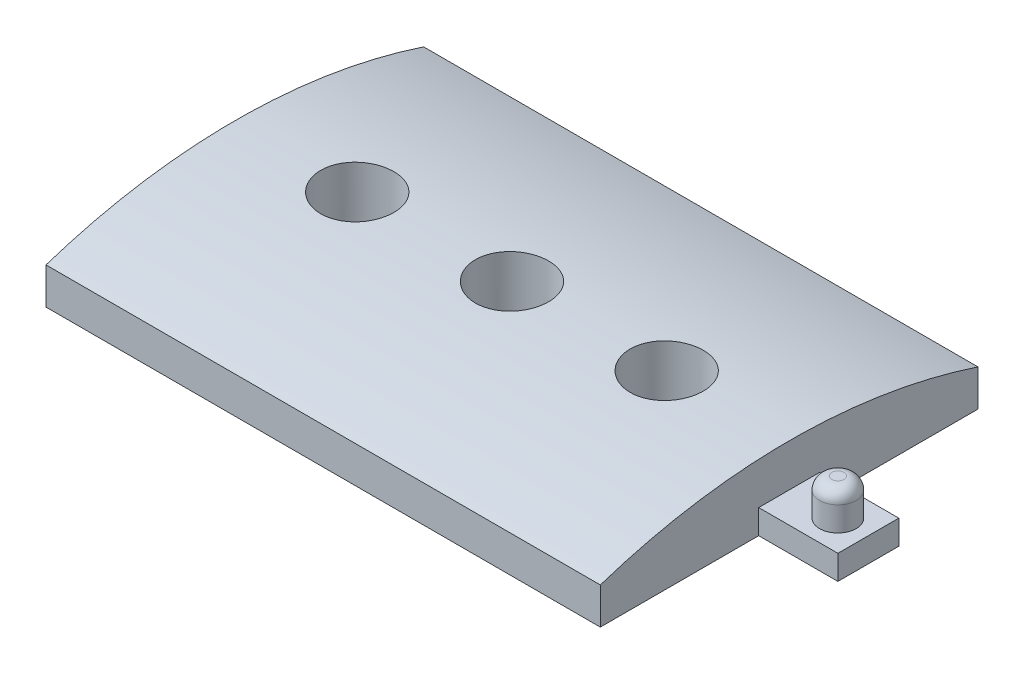
ISO-10303-21;
HEADER;
FILE_DESCRIPTION(('STEP AP214'),'2;1');
FILE_NAME('part.step','',(''),(''),'','','');
FILE_SCHEMA(('AUTOMOTIVE_DESIGN { 1 0 10303 214 1 1 1 1 }'));
ENDSEC;
DATA;
#1=APPLICATION_CONTEXT('core data for automotive mechanical design processes');
#2=APPLICATION_PROTOCOL_DEFINITION('international standard','automotive_design',2000,#1);
#3=PRODUCT_CONTEXT('',#1,'mechanical');
#4=PRODUCT('Part','Part','',(#3));
#5=PRODUCT_RELATED_PRODUCT_CATEGORY('part','',(#4));
#6=PRODUCT_DEFINITION_FORMATION('','',#4);
#7=PRODUCT_DEFINITION_CONTEXT('part definition',#1,'design');
#8=PRODUCT_DEFINITION('design','',#6,#7);
#9=PRODUCT_DEFINITION_SHAPE('','',#8);
#10=(LENGTH_UNIT() NAMED_UNIT(*) SI_UNIT(.MILLI.,.METRE.));
#11=(NAMED_UNIT(*) PLANE_ANGLE_UNIT() SI_UNIT($,.RADIAN.));
#12=(NAMED_UNIT(*) SI_UNIT($,.STERADIAN.) SOLID_ANGLE_UNIT());
#13=UNCERTAINTY_MEASURE_WITH_UNIT(LENGTH_MEASURE(1.E-05),#10,'distance_accuracy_value','');
#14=(GEOMETRIC_REPRESENTATION_CONTEXT(3) GLOBAL_UNCERTAINTY_ASSIGNED_CONTEXT((#13)) GLOBAL_UNIT_ASSIGNED_CONTEXT((#10,
#11,#12)) REPRESENTATION_CONTEXT('',''));
#15=CARTESIAN_POINT('',(0.,0.,0.));
#16=DIRECTION('',(0.,0.,1.));
#17=DIRECTION('',(1.,0.,0.));
#18=AXIS2_PLACEMENT_3D('',#15,#16,#17);
#19=CARTESIAN_POINT('',(107.701286160336,-87.6000000000001,0.));
#20=DIRECTION('',(-1.,0.,0.));
#21=DIRECTION('',(0.,0.,1.));
#22=AXIS2_PLACEMENT_3D('',#19,#20,#21);
#23=CYLINDRICAL_SURFACE('',#22,98.6000000000001);
#24=CARTESIAN_POINT('',(45.5,-87.6000000000001,0.));
#25=DIRECTION('',(-1.,0.,0.));
#26=DIRECTION('',(0.,0.,1.));
#27=AXIS2_PLACEMENT_3D('',#24,#25,#26);
#28=CIRCLE('',#27,98.6000000000001);
#29=CARTESIAN_POINT('',(45.5,6.,-31.));
#30=VERTEX_POINT('',#29);
#31=CARTESIAN_POINT('',(45.5,6.,31.));
#32=VERTEX_POINT('',#31);
#33=EDGE_CURVE('E135',#30,#32,#28,.F.);
#34=ORIENTED_EDGE('',*,*,#33,.F.);
#35=DIRECTION('',(-1.,0.,0.));
#36=VECTOR('',#35,1.);
#37=CARTESIAN_POINT('',(-45.5,6.,-31.));
#38=LINE('',#37,#36);
#39=CARTESIAN_POINT('',(-45.5,6.,-31.));
#40=VERTEX_POINT('',#39);
#41=EDGE_CURVE('E99',#30,#40,#38,.T.);
#42=ORIENTED_EDGE('',*,*,#41,.T.);
#43=CARTESIAN_POINT('',(-45.5,-87.6000000000001,0.));
#44=DIRECTION('',(-1.,0.,0.));
#45=DIRECTION('',(0.,0.,-1.));
#46=AXIS2_PLACEMENT_3D('',#43,#44,#45);
#47=CIRCLE('',#46,98.6000000000001);
#48=CARTESIAN_POINT('',(-45.5,6.,31.));
#49=VERTEX_POINT('',#48);
#50=EDGE_CURVE('E142',#49,#40,#47,.T.);
#51=ORIENTED_EDGE('',*,*,#50,.F.);
#52=DIRECTION('',(1.,0.,0.));
#53=VECTOR('',#52,1.);
#54=CARTESIAN_POINT('',(-45.5,6.,31.));
#55=LINE('',#54,#53);
#56=EDGE_CURVE('E127',#49,#32,#55,.T.);
#57=ORIENTED_EDGE('',*,*,#56,.T.);
#58=EDGE_LOOP('',(#34,#42,#51,#57));
#59=FACE_BOUND('',#58,.T.);
#60=CARTESIAN_POINT('',(19.4,11.,0.));
#61=CARTESIAN_POINT('',(19.3999986321025,11.000000229658,-0.168404413600146));
#62=CARTESIAN_POINT('',(19.4070928390863,10.999567663761,-0.336786986551726));
#63=CARTESIAN_POINT('',(19.4354190000614,10.9978499742835,-0.672409169286409));
#64=CARTESIAN_POINT('',(19.4566545520299,10.9965646337322,-0.839648477246152));
#65=CARTESIAN_POINT('',(19.5131402179147,10.9931758595845,-1.17187936018386));
#66=CARTESIAN_POINT('',(19.5484023298773,10.9910717256417,-1.33686888545236));
#67=CARTESIAN_POINT('',(19.6327025236125,10.986104246697,-1.66334370325823));
#68=CARTESIAN_POINT('',(19.6817456420605,10.9832406241391,-1.82482769130483));
#69=CARTESIAN_POINT('',(19.793200799089,10.9768385960297,-2.14293766353576));
#70=CARTESIAN_POINT('',(19.8556008462217,10.9733007960451,-2.29956786185985));
#71=CARTESIAN_POINT('',(19.9933755810975,10.9656474543999,-2.60706873711054));
#72=CARTESIAN_POINT('',(20.0687550447709,10.9615317001773,-2.75793726890809));
#73=CARTESIAN_POINT('',(20.2318865655336,10.9528425260403,-3.05269724160954));
#74=CARTESIAN_POINT('',(20.3196311631378,10.9482693825333,-3.19659281924973));
#75=CARTESIAN_POINT('',(20.5069391147091,10.9387908229136,-3.47653984698354));
#76=CARTESIAN_POINT('',(20.6065068248148,10.9338852846202,-3.61258837829007));
#77=CARTESIAN_POINT('',(20.8168233714441,10.9238776596673,-3.87594041006536));
#78=CARTESIAN_POINT('',(20.9275820694516,10.9187754021507,-4.00323602855471));
#79=CARTESIAN_POINT('',(21.1594652748157,10.9085210417277,-4.24809453220113));
#80=CARTESIAN_POINT('',(21.2805935961729,10.9033689211048,-4.36565380473109));
#81=CARTESIAN_POINT('',(21.5322822594511,10.8931644296815,-4.59011796019534));
#82=CARTESIAN_POINT('',(21.6628395035259,10.8881120268077,-4.69702631523764));
#83=CARTESIAN_POINT('',(21.9325473852962,10.8782466491957,-4.89951211913757));
#84=CARTESIAN_POINT('',(22.0717011772949,10.8734337635265,-4.99508537083317));
#85=CARTESIAN_POINT('',(22.3576314062376,10.8641842867918,-5.17421139305048));
#86=CARTESIAN_POINT('',(22.5044108403343,10.8597478455144,-5.25775938781928));
#87=CARTESIAN_POINT('',(22.8045520854735,10.8513780162472,-5.4122224236668));
#88=CARTESIAN_POINT('',(22.9579163095742,10.8474448148126,-5.48313278367825));
#89=CARTESIAN_POINT('',(23.27004349295,10.8401971327605,-5.61175110253336));
#90=CARTESIAN_POINT('',(23.4288043914026,10.8368824190311,-5.66946403743035));
#91=CARTESIAN_POINT('',(23.7506499575588,10.8309624687199,-5.77132480013478));
#92=CARTESIAN_POINT('',(23.9137361975389,10.8283574941197,-5.81546761966182));
#93=CARTESIAN_POINT('',(24.4072211348461,10.8217360556224,-5.9268649321302));
#94=CARTESIAN_POINT('',(24.7425812887715,10.8188954689223,-5.97339041077554));
#95=CARTESIAN_POINT('',(25.4161803609237,10.8166988396797,-6.00946456516706));
#96=CARTESIAN_POINT('',(25.7544192479374,10.8173427594038,-5.99901385790196));
#97=CARTESIAN_POINT('',(26.4239227236938,10.8220329413092,-5.92156388811038));
#98=CARTESIAN_POINT('',(26.7551959977812,10.8260746728429,-5.85463992666142));
#99=CARTESIAN_POINT('',(27.401784901934,10.8370994378133,-5.66624021503213));
#100=CARTESIAN_POINT('',(27.7171004404362,10.8440824881246,-5.54476415187887));
#101=CARTESIAN_POINT('',(28.3230812375132,10.8602077237547,-5.25062819961125));
#102=CARTESIAN_POINT('',(28.6137298616548,10.8693513506043,-5.07793411825943));
#103=CARTESIAN_POINT('',(29.1619402151687,10.8887659564162,-4.68628766227296));
#104=CARTESIAN_POINT('',(29.4195015925214,10.8990369473706,-4.46733479555052));
#105=CARTESIAN_POINT('',(29.8946656354831,10.9195688821282,-3.98896207160927));
#106=CARTESIAN_POINT('',(30.1122026761889,10.9298297824703,-3.72947702213265));
#107=CARTESIAN_POINT('',(30.5006365342967,10.9491691327505,-3.17763428645061));
#108=CARTESIAN_POINT('',(30.6715333361811,10.9582475822952,-2.88527658930834));
#109=CARTESIAN_POINT('',(30.9618300028031,10.9741996739195,-2.2759479519847));
#110=CARTESIAN_POINT('',(31.0812274102538,10.981073210788,-1.95897583818103));
#111=CARTESIAN_POINT('',(31.2650923079146,10.9918394802028,-1.30943370866304));
#112=CARTESIAN_POINT('',(31.3295604063244,10.9957322457533,-0.976863865696146));
#113=CARTESIAN_POINT('',(31.4016554260109,11.0000940572429,-0.306136154127039));
#114=CARTESIAN_POINT('',(31.40937308585,11.000568568621,0.0320119272216248));
#115=CARTESIAN_POINT('',(31.3679851885813,10.998054933762,0.704797930150374));
#116=CARTESIAN_POINT('',(31.3188799115715,10.9950668045932,1.03943586902483));
#117=CARTESIAN_POINT('',(31.165315210082,10.9859678197957,1.69544702060426));
#118=CARTESIAN_POINT('',(31.060897387574,10.9798593112066,2.01683000714486));
#119=CARTESIAN_POINT('',(30.7997137904376,10.9652068701669,2.63750994271739));
#120=CARTESIAN_POINT('',(30.6429475693133,10.9566629169437,2.93680670334238));
#121=CARTESIAN_POINT('',(30.2812863369532,10.9380861568064,3.50523396672023));
#122=CARTESIAN_POINT('',(30.0763306917541,10.9280514801061,3.77432582898067));
#123=CARTESIAN_POINT('',(29.6241956544052,10.9076289671518,4.27431571859182));
#124=CARTESIAN_POINT('',(29.3770158675548,10.8972411275972,4.5052133888733));
#125=CARTESIAN_POINT('',(28.847062244764,10.8772672130113,4.9225681315088));
#126=CARTESIAN_POINT('',(28.5642420261357,10.8676822103569,5.10896636011965));
#127=CARTESIAN_POINT('',(27.9712523328972,10.8504121732547,5.43162681378833));
#128=CARTESIAN_POINT('',(27.661083019828,10.8427271275854,5.56788933495463));
#129=CARTESIAN_POINT('',(27.0224776451457,10.8301304313161,5.7863150192272));
#130=CARTESIAN_POINT('',(26.6940542791259,10.8252168790286,5.86851528412744));
#131=CARTESIAN_POINT('',(26.0278532018344,10.8187155358368,5.97657955035302));
#132=CARTESIAN_POINT('',(25.6900755776727,10.8171277139728,6.00244407611755));
#133=CARTESIAN_POINT('',(25.1843583395823,10.8173653869707,5.99850101348707));
#134=CARTESIAN_POINT('',(25.0159902563826,10.8178806779035,5.99007153183835));
#135=CARTESIAN_POINT('',(24.6805802222139,10.8197619533792,5.95908924741543));
#136=CARTESIAN_POINT('',(24.5135378038821,10.8211276232767,5.93654166840664));
#137=CARTESIAN_POINT('',(24.1819005727569,10.8246728901136,5.8774678283244));
#138=CARTESIAN_POINT('',(24.0173066874708,10.8268527877107,5.84093640351949));
#139=CARTESIAN_POINT('',(23.6918431263065,10.8319630038836,5.75417658143367));
#140=CARTESIAN_POINT('',(23.5309721035247,10.8348930462837,5.70395322457563));
#141=CARTESIAN_POINT('',(23.2139786040331,10.8414219963264,5.5901414819829));
#142=CARTESIAN_POINT('',(23.0578578642017,10.8450211452789,5.526548273392));
#143=CARTESIAN_POINT('',(22.751586368245,10.8527839386548,5.38648765319828));
#144=CARTESIAN_POINT('',(22.6014334395943,10.8569473751748,5.3100249806626));
#145=CARTESIAN_POINT('',(22.3080479068997,10.8657232602529,5.14472465747023));
#146=CARTESIAN_POINT('',(22.164817666888,10.8703358605976,5.05588281910301));
#147=CARTESIAN_POINT('',(21.8863942909173,10.8798764775494,4.86650902789028));
#148=CARTESIAN_POINT('',(21.7511982271495,10.8848043778787,4.76598137355279));
#149=CARTESIAN_POINT('',(21.4894932363414,10.8948472247035,4.55372111898794));
#150=CARTESIAN_POINT('',(21.363001111002,10.8999625052827,4.44196781813168));
#151=CARTESIAN_POINT('',(21.119923349289,10.9102244027455,4.20824920056375));
#152=CARTESIAN_POINT('',(21.0033340895992,10.9153710074228,4.08628765161431));
#153=CARTESIAN_POINT('',(20.7807664953992,10.925554798005,3.83290155872265));
#154=CARTESIAN_POINT('',(20.6747947211689,10.9305919147732,3.70147124942557));
#155=CARTESIAN_POINT('',(20.474332648823,10.940408850239,3.43019457863328));
#156=CARTESIAN_POINT('',(20.379838129921,10.9451887631615,3.29035133947521));
#157=CARTESIAN_POINT('',(20.2028176534637,10.9543650740029,3.0029687086061));
#158=CARTESIAN_POINT('',(20.1203106956577,10.9587608587951,2.85541759272442));
#159=CARTESIAN_POINT('',(19.9680600009059,10.9670340091936,2.55392595976248));
#160=CARTESIAN_POINT('',(19.8983116011887,10.9709115640533,2.39998780223936));
#161=CARTESIAN_POINT('',(19.7720946749389,10.9780368394766,2.08689792932769));
#162=CARTESIAN_POINT('',(19.7156147019479,10.9812851024927,1.92775084365926));
#163=CARTESIAN_POINT('',(19.6162764853103,10.9870630666256,1.60530452769256));
#164=CARTESIAN_POINT('',(19.5734147485516,10.9895929519905,1.44200637377908));
#165=CARTESIAN_POINT('',(19.4918550122965,10.9944423658382,1.06761341251458));
#166=CARTESIAN_POINT('',(19.4574400104625,10.9965186967876,0.855568627188631));
#167=CARTESIAN_POINT('',(19.41151339034,10.9992973667236,0.429004083006509));
#168=CARTESIAN_POINT('',(19.4000017421905,10.9999997075015,0.214484327377525));
#169=CARTESIAN_POINT('',(19.4,11.,0.));
#170=B_SPLINE_CURVE_WITH_KNOTS('',3,(#60,#61,#62,#63,#64,#65,#66,#67,#68,#69,#70,#71,#72,#73,
#74,#75,#76,#77,#78,#79,#80,#81,#82,#83,#84,#85,#86,#87,#88,#89,#90,#91,#92,#93,#94,#95,#96,#97,
#98,#99,#100,#101,#102,#103,#104,#105,#106,#107,#108,#109,#110,#111,#112,#113,#114,#115,#116,
#117,#118,#119,#120,#121,#122,#123,#124,#125,#126,#127,#128,#129,#130,#131,#132,#133,#134,#135,
#136,#137,#138,#139,#140,#141,#142,#143,#144,#145,#146,#147,#148,#149,#150,#151,#152,#153,#154,
#155,#156,#157,#158,#159,#160,#161,#162,#163,#164,#165,#166,#167,#168,#169),.UNSPECIFIED.,.T.,
.F.,(4,2,2,2,2,2,2,2,2,2,2,2,2,2,2,2,2,2,2,2,2,2,2,2,2,2,2,2,2,2,2,2,2,2,2,2,2,2,2,2,2,2,2,2,2,
2,2,2,2,2,2,2,2,2,4),(0.,0.50502581636515,1.01018017538683,1.51576756601272,2.02153997934308,
2.52686021573891,3.03236678961708,3.53756970292469,4.04295933546867,4.54879826642407,
5.05482405351433,5.56068433701458,6.0667313495032,6.57297878400881,7.07941334808698,
7.5856566463778,8.09208655862317,9.10259127011719,10.1130850389909,11.1222335470924,
12.1313878448921,13.1412173584121,14.1510576147517,15.1625391554189,16.174021032611,
17.1855511671895,18.197070101548,19.2069713607929,20.2168676419428,21.2260054306534,
22.2351518268365,23.2455748334825,24.2560072858206,25.2677685708438,26.2795238801681,
27.2905841164726,28.3016349406015,28.806882789571,29.3119438047334,29.8171915009615,
30.3222534504908,30.8274979026733,31.3325567084549,31.8377867857359,32.3428316038912,
32.848825469486,33.3546333944548,33.8607519427835,34.3666837976835,34.8734089833847,
35.3799486085494,35.8860496321286,36.3920207345209,37.035235846536,37.6784501199371),.UNSPECIFIED.);
#171=CARTESIAN_POINT('',(19.4,11.,0.));
#172=VERTEX_POINT('',#171);
#173=EDGE_CURVE('E182',#172,#172,#170,.T.);
#174=ORIENTED_EDGE('',*,*,#173,.T.);
#175=EDGE_LOOP('',(#174));
#176=FACE_BOUND('',#175,.T.);
#177=CARTESIAN_POINT('',(-6.00000000000003,11.,0.));
#178=CARTESIAN_POINT('',(-6.0000013678975,11.000000229658,-0.168404413600146));
#179=CARTESIAN_POINT('',(-5.99290716091364,10.999567663761,-0.336786986551725));
#180=CARTESIAN_POINT('',(-5.9645809999386,10.9978499742835,-0.672409169286408));
#181=CARTESIAN_POINT('',(-5.94334544797006,10.9965646337322,-0.83964847724615));
#182=CARTESIAN_POINT('',(-5.88685978208534,10.9931758595845,-1.17187936018385));
#183=CARTESIAN_POINT('',(-5.85159767012269,10.9910717256417,-1.33686888545236));
#184=CARTESIAN_POINT('',(-5.7672974763875,10.986104246697,-1.66334370325823));
#185=CARTESIAN_POINT('',(-5.71825435793953,10.9832406241391,-1.82482769130483));
#186=CARTESIAN_POINT('',(-5.60679920091101,10.9768385960297,-2.14293766353575));
#187=CARTESIAN_POINT('',(-5.54439915377834,10.9733007960451,-2.29956786185984));
#188=CARTESIAN_POINT('',(-5.40662441890252,10.9656474543999,-2.60706873711053));
#189=CARTESIAN_POINT('',(-5.3312449552291,10.9615317001773,-2.75793726890809));
#190=CARTESIAN_POINT('',(-5.16811343446634,10.9528425260403,-3.05269724160953));
#191=CARTESIAN_POINT('',(-5.08036883686218,10.9482693825333,-3.19659281924972));
#192=CARTESIAN_POINT('',(-4.89306088529088,10.9387908229136,-3.47653984698353));
#193=CARTESIAN_POINT('',(-4.79349317518516,10.9338852846202,-3.61258837829006));
#194=CARTESIAN_POINT('',(-4.58317662855591,10.9238776596673,-3.87594041006535));
#195=CARTESIAN_POINT('',(-4.47241793054841,10.9187754021507,-4.0032360285547));
#196=CARTESIAN_POINT('',(-4.24053472518432,10.9085210417277,-4.24809453220112));
#197=CARTESIAN_POINT('',(-4.11940640382706,10.9033689211048,-4.36565380473108));
#198=CARTESIAN_POINT('',(-3.86771774054888,10.8931644296816,-4.59011796019534));
#199=CARTESIAN_POINT('',(-3.73716049647405,10.8881120268077,-4.69702631523763));
#200=CARTESIAN_POINT('',(-3.46745261470377,10.8782466491957,-4.89951211913756));
#201=CARTESIAN_POINT('',(-3.32829882270514,10.8734337635265,-4.99508537083316));
#202=CARTESIAN_POINT('',(-3.04236859376242,10.8641842867918,-5.17421139305047));
#203=CARTESIAN_POINT('',(-2.8955891596657,10.8597478455144,-5.25775938781927));
#204=CARTESIAN_POINT('',(-2.5954479145265,10.8513780162472,-5.41222242366679));
#205=CARTESIAN_POINT('',(-2.44208369042577,10.8474448148126,-5.48313278367824));
#206=CARTESIAN_POINT('',(-2.12995650705003,10.8401971327605,-5.61175110253334));
#207=CARTESIAN_POINT('',(-1.97119560859741,10.8368824190311,-5.66946403743034));
#208=CARTESIAN_POINT('',(-1.64935004244119,10.8309624687199,-5.77132480013477));
#209=CARTESIAN_POINT('',(-1.48626380246111,10.8283574941197,-5.81546761966181));
#210=CARTESIAN_POINT('',(-0.992778865153893,10.8217360556224,-5.92686493213019));
#211=CARTESIAN_POINT('',(-0.657418711228511,10.8188954689223,-5.97339041077553));
#212=CARTESIAN_POINT('',(0.0161803609236574,10.8166988396797,-6.00946456516704));
#213=CARTESIAN_POINT('',(0.354419247937365,10.8173427594038,-5.99901385790195));
#214=CARTESIAN_POINT('',(1.02392272369378,10.8220329413092,-5.92156388811037));
#215=CARTESIAN_POINT('',(1.35519599778122,10.8260746728429,-5.85463992666141));
#216=CARTESIAN_POINT('',(2.00178490193404,10.8370994378133,-5.66624021503212));
#217=CARTESIAN_POINT('',(2.31710044043616,10.8440824881246,-5.54476415187886));
#218=CARTESIAN_POINT('',(2.92308123751322,10.8602077237547,-5.25062819961124));
#219=CARTESIAN_POINT('',(3.2137298616548,10.8693513506043,-5.07793411825943));
#220=CARTESIAN_POINT('',(3.76194021516869,10.8887659564162,-4.68628766227295));
#221=CARTESIAN_POINT('',(4.01950159252144,10.8990369473706,-4.46733479555051));
#222=CARTESIAN_POINT('',(4.49466563548311,10.9195688821282,-3.98896207160926));
#223=CARTESIAN_POINT('',(4.71220267618892,10.9298297824703,-3.72947702213264));
#224=CARTESIAN_POINT('',(5.10063653429665,10.9491691327505,-3.17763428645061));
#225=CARTESIAN_POINT('',(5.27153333618112,10.9582475822952,-2.88527658930834));
#226=CARTESIAN_POINT('',(5.56183000280306,10.9741996739195,-2.27594795198469));
#227=CARTESIAN_POINT('',(5.68122741025375,10.981073210788,-1.95897583818103));
#228=CARTESIAN_POINT('',(5.86509230791457,10.9918394802028,-1.30943370866303));
#229=CARTESIAN_POINT('',(5.92956040632443,10.9957322457533,-0.976863865696142));
#230=CARTESIAN_POINT('',(6.0016554260109,11.0000940572429,-0.306136154127036));
#231=CARTESIAN_POINT('',(6.00937308584999,11.000568568621,0.0320119272216275));
#232=CARTESIAN_POINT('',(5.96798518858133,10.998054933762,0.704797930150375));
#233=CARTESIAN_POINT('',(5.91887991157145,10.9950668045932,1.03943586902483));
#234=CARTESIAN_POINT('',(5.76531521008204,10.9859678197957,1.69544702060426));
#235=CARTESIAN_POINT('',(5.660897387574,10.9798593112066,2.01683000714486));
#236=CARTESIAN_POINT('',(5.3997137904376,10.9652068701669,2.63750994271739));
#237=CARTESIAN_POINT('',(5.24294756931333,10.9566629169437,2.93680670334238));
#238=CARTESIAN_POINT('',(4.88128633695315,10.9380861568064,3.50523396672022));
#239=CARTESIAN_POINT('',(4.67633069175414,10.9280514801061,3.77432582898067));
#240=CARTESIAN_POINT('',(4.2241956544052,10.9076289671518,4.27431571859182));
#241=CARTESIAN_POINT('',(3.97701586755482,10.8972411275972,4.50521338887329));
#242=CARTESIAN_POINT('',(3.447062244764,10.8772672130113,4.92256813150879));
#243=CARTESIAN_POINT('',(3.16424202613565,10.8676822103569,5.10896636011964));
#244=CARTESIAN_POINT('',(2.57125233289715,10.8504121732546,5.43162681378831));
#245=CARTESIAN_POINT('',(2.26108301982797,10.8427271275854,5.56788933495462));
#246=CARTESIAN_POINT('',(1.62247764514567,10.8301304313161,5.78631501922719));
#247=CARTESIAN_POINT('',(1.29405427912593,10.8252168790286,5.86851528412743));
#248=CARTESIAN_POINT('',(0.627853201834412,10.8187155358368,5.97657955035301));
#249=CARTESIAN_POINT('',(0.290075577672692,10.8171277139728,6.00244407611753));
#250=CARTESIAN_POINT('',(-0.215641660417663,10.8173653869707,5.99850101348706));
#251=CARTESIAN_POINT('',(-0.384009743617375,10.8178806779035,5.99007153183834));
#252=CARTESIAN_POINT('',(-0.719419777786138,10.8197619533792,5.95908924741542));
#253=CARTESIAN_POINT('',(-0.886462196117925,10.8211276232767,5.93654166840662));
#254=CARTESIAN_POINT('',(-1.21809942724309,10.8246728901136,5.87746782832439));
#255=CARTESIAN_POINT('',(-1.38269331252925,10.8268527877107,5.84093640351948));
#256=CARTESIAN_POINT('',(-1.70815687369353,10.8319630038836,5.75417658143366));
#257=CARTESIAN_POINT('',(-1.86902789647534,10.8348930462837,5.70395322457562));
#258=CARTESIAN_POINT('',(-2.18602139596691,10.8414219963264,5.59014148198289));
#259=CARTESIAN_POINT('',(-2.34214213579828,10.8450211452789,5.52654827339199));
#260=CARTESIAN_POINT('',(-2.64841363175498,10.8527839386548,5.38648765319827));
#261=CARTESIAN_POINT('',(-2.79856656040574,10.8569473751748,5.31002498066259));
#262=CARTESIAN_POINT('',(-3.09195209310034,10.8657232602529,5.14472465747022));
#263=CARTESIAN_POINT('',(-3.23518233311196,10.8703358605976,5.05588281910299));
#264=CARTESIAN_POINT('',(-3.51360570908265,10.8798764775494,4.86650902789027));
#265=CARTESIAN_POINT('',(-3.64880177285047,10.8848043778787,4.76598137355278));
#266=CARTESIAN_POINT('',(-3.91050676365855,10.8948472247035,4.55372111898793));
#267=CARTESIAN_POINT('',(-4.03699888899794,10.8999625052827,4.44196781813167));
#268=CARTESIAN_POINT('',(-4.28007665071103,10.9102244027455,4.20824920056374));
#269=CARTESIAN_POINT('',(-4.39666591040081,10.9153710074228,4.08628765161431));
#270=CARTESIAN_POINT('',(-4.61923350460081,10.925554798005,3.83290155872264));
#271=CARTESIAN_POINT('',(-4.72520527883114,10.9305919147732,3.70147124942556));
#272=CARTESIAN_POINT('',(-4.92566735117702,10.940408850239,3.43019457863328));
#273=CARTESIAN_POINT('',(-5.02016187007894,10.9451887631615,3.29035133947521));
#274=CARTESIAN_POINT('',(-5.19718234653632,10.9543650740029,3.00296870860609));
#275=CARTESIAN_POINT('',(-5.27968930434224,10.9587608587951,2.85541759272441));
#276=CARTESIAN_POINT('',(-5.43193999909409,10.9670340091936,2.55392595976248));
#277=CARTESIAN_POINT('',(-5.5016883988113,10.9709115640533,2.39998780223935));
#278=CARTESIAN_POINT('',(-5.62790532506112,10.9780368394766,2.08689792932769));
#279=CARTESIAN_POINT('',(-5.68438529805204,10.9812851024927,1.92775084365926));
#280=CARTESIAN_POINT('',(-5.7837235146897,10.9870630666256,1.60530452769256));
#281=CARTESIAN_POINT('',(-5.82658525144837,10.9895929519905,1.44200637377908));
#282=CARTESIAN_POINT('',(-5.90814498770351,10.9944423658382,1.06761341251457));
#283=CARTESIAN_POINT('',(-5.94255998953754,10.9965186967876,0.855568627188627));
#284=CARTESIAN_POINT('',(-5.98848660966004,10.9992973667236,0.429004083006506));
#285=CARTESIAN_POINT('',(-5.99999825780953,10.9999997075015,0.214484327377524));
#286=CARTESIAN_POINT('',(-6.00000000000003,11.,0.));
#287=B_SPLINE_CURVE_WITH_KNOTS('',3,(#177,#178,#179,#180,#181,#182,#183,#184,#185,#186,#187,
#188,#189,#190,#191,#192,#193,#194,#195,#196,#197,#198,#199,#200,#201,#202,#203,#204,#205,#206,
#207,#208,#209,#210,#211,#212,#213,#214,#215,#216,#217,#218,#219,#220,#221,#222,#223,#224,#225,
#226,#227,#228,#229,#230,#231,#232,#233,#234,#235,#236,#237,#238,#239,#240,#241,#242,#243,#244,
#245,#246,#247,#248,#249,#250,#251,#252,#253,#254,#255,#256,#257,#258,#259,#260,#261,#262,#263,
#264,#265,#266,#267,#268,#269,#270,#271,#272,#273,#274,#275,#276,#277,#278,#279,#280,#281,#282,
#283,#284,#285,#286),.UNSPECIFIED.,.T.,.F.,(4,2,2,2,2,2,2,2,2,2,2,2,2,2,2,2,2,2,2,2,2,2,2,2,2,2,
2,2,2,2,2,2,2,2,2,2,2,2,2,2,2,2,2,2,2,2,2,2,2,2,2,2,2,2,4),(0.,0.505025816365149,
1.01018017538683,1.51576756601271,2.02153997934308,2.5268602157389,3.03236678961707,
3.53756970292468,4.04295933546866,4.54879826642406,5.05482405351432,5.56068433701457,
6.06673134950319,6.5729787840088,7.07941334808696,7.58565664637778,8.09208655862315,
9.10259127011717,10.1130850389909,11.1222335470924,12.1313878448921,13.141217358412,
14.1510576147517,15.1625391554189,16.174021032611,17.1855511671895,18.197070101548,
19.2069713607929,20.2168676419427,21.2260054306533,22.2351518268365,23.2455748334824,
24.2560072858206,25.2677685708437,26.279523880168,27.2905841164726,28.3016349406014,
28.8068827895709,29.3119438047333,29.8171915009614,30.3222534504907,30.8274979026733,
31.3325567084549,31.8377867857358,32.3428316038912,32.8488254694859,33.3546333944547,
33.8607519427835,34.3666837976834,34.8734089833846,35.3799486085493,35.8860496321286,
36.3920207345208,37.0352358465359,37.678450119937),.UNSPECIFIED.);
#288=CARTESIAN_POINT('',(-6.00000000000003,11.,0.));
#289=VERTEX_POINT('',#288);
#290=EDGE_CURVE('E57',#289,#289,#287,.T.);
#291=ORIENTED_EDGE('',*,*,#290,.T.);
#292=EDGE_LOOP('',(#291));
#293=FACE_BOUND('',#292,.T.);
#294=CARTESIAN_POINT('',(-31.4,11.,0.));
#295=CARTESIAN_POINT('',(-31.4000013678975,11.000000229658,-0.168404413600146));
#296=CARTESIAN_POINT('',(-31.3929071609136,10.999567663761,-0.336786986551725));
#297=CARTESIAN_POINT('',(-31.3645809999386,10.9978499742835,-0.67240916928641));
#298=CARTESIAN_POINT('',(-31.3433454479701,10.9965646337322,-0.839648477246152));
#299=CARTESIAN_POINT('',(-31.2868597820853,10.9931758595845,-1.17187936018386));
#300=CARTESIAN_POINT('',(-31.2515976701227,10.9910717256417,-1.33686888545236));
#301=CARTESIAN_POINT('',(-31.1672974763875,10.986104246697,-1.66334370325823));
#302=CARTESIAN_POINT('',(-31.1182543579395,10.9832406241391,-1.82482769130483));
#303=CARTESIAN_POINT('',(-31.006799200911,10.9768385960297,-2.14293766353575));
#304=CARTESIAN_POINT('',(-30.9443991537783,10.9733007960451,-2.29956786185984));
#305=CARTESIAN_POINT('',(-30.8066244189025,10.9656474543999,-2.60706873711054));
#306=CARTESIAN_POINT('',(-30.7312449552291,10.9615317001773,-2.75793726890809));
#307=CARTESIAN_POINT('',(-30.5681134344663,10.9528425260403,-3.05269724160954));
#308=CARTESIAN_POINT('',(-30.4803688368622,10.9482693825333,-3.19659281924972));
#309=CARTESIAN_POINT('',(-30.2930608852909,10.9387908229136,-3.47653984698353));
#310=CARTESIAN_POINT('',(-30.1934931751852,10.9338852846202,-3.61258837829006));
#311=CARTESIAN_POINT('',(-29.9831766285559,10.9238776596673,-3.87594041006535));
#312=CARTESIAN_POINT('',(-29.8724179305484,10.9187754021507,-4.00323602855471));
#313=CARTESIAN_POINT('',(-29.6405347251843,10.9085210417277,-4.24809453220113));
#314=CARTESIAN_POINT('',(-29.5194064038271,10.9033689211048,-4.36565380473109));
#315=CARTESIAN_POINT('',(-29.2677177405489,10.8931644296816,-4.59011796019534));
#316=CARTESIAN_POINT('',(-29.1371604964741,10.8881120268077,-4.69702631523763));
#317=CARTESIAN_POINT('',(-28.8674526147038,10.8782466491957,-4.89951211913756));
#318=CARTESIAN_POINT('',(-28.7282988227051,10.8734337635265,-4.99508537083316));
#319=CARTESIAN_POINT('',(-28.4423685937624,10.8641842867918,-5.17421139305047));
#320=CARTESIAN_POINT('',(-28.2955891596657,10.8597478455144,-5.25775938781927));
#321=CARTESIAN_POINT('',(-27.9954479145265,10.8513780162472,-5.41222242366679));
#322=CARTESIAN_POINT('',(-27.8420836904258,10.8474448148126,-5.48313278367824));
#323=CARTESIAN_POINT('',(-27.52995650705,10.8401971327605,-5.61175110253335));
#324=CARTESIAN_POINT('',(-27.3711956085974,10.8368824190311,-5.66946403743035));
#325=CARTESIAN_POINT('',(-27.0493500424412,10.8309624687199,-5.77132480013478));
#326=CARTESIAN_POINT('',(-26.8862638024611,10.8283574941197,-5.81546761966182));
#327=CARTESIAN_POINT('',(-26.3927788651539,10.8217360556224,-5.9268649321302));
#328=CARTESIAN_POINT('',(-26.0574187112285,10.8188954689223,-5.97339041077553));
#329=CARTESIAN_POINT('',(-25.3838196390763,10.8166988396797,-6.00946456516705));
#330=CARTESIAN_POINT('',(-25.0455807520626,10.8173427594038,-5.99901385790196));
#331=CARTESIAN_POINT('',(-24.3760772763062,10.8220329413092,-5.92156388811038));
#332=CARTESIAN_POINT('',(-24.0448040022188,10.8260746728429,-5.85463992666142));
#333=CARTESIAN_POINT('',(-23.398215098066,10.8370994378133,-5.66624021503213));
#334=CARTESIAN_POINT('',(-23.0828995595638,10.8440824881246,-5.54476415187887));
#335=CARTESIAN_POINT('',(-22.4769187624868,10.8602077237547,-5.25062819961125));
#336=CARTESIAN_POINT('',(-22.1862701383452,10.8693513506043,-5.07793411825943));
#337=CARTESIAN_POINT('',(-21.6380597848313,10.8887659564162,-4.68628766227296));
#338=CARTESIAN_POINT('',(-21.3804984074786,10.8990369473706,-4.46733479555052));
#339=CARTESIAN_POINT('',(-20.9053343645169,10.9195688821282,-3.98896207160927));
#340=CARTESIAN_POINT('',(-20.6877973238111,10.9298297824703,-3.72947702213265));
#341=CARTESIAN_POINT('',(-20.2993634657033,10.9491691327505,-3.17763428645061));
#342=CARTESIAN_POINT('',(-20.1284666638189,10.9582475822952,-2.88527658930835));
#343=CARTESIAN_POINT('',(-19.8381699971969,10.9741996739195,-2.2759479519847));
#344=CARTESIAN_POINT('',(-19.7187725897462,10.981073210788,-1.95897583818103));
#345=CARTESIAN_POINT('',(-19.5349076920854,10.9918394802028,-1.30943370866304));
#346=CARTESIAN_POINT('',(-19.4704395936756,10.9957322457533,-0.976863865696148));
#347=CARTESIAN_POINT('',(-19.3983445739891,11.0000940572429,-0.306136154127041));
#348=CARTESIAN_POINT('',(-19.39062691415,11.000568568621,0.0320119272216223));
#349=CARTESIAN_POINT('',(-19.4320148114187,10.998054933762,0.70479793015037));
#350=CARTESIAN_POINT('',(-19.4811200884285,10.9950668045932,1.03943586902483));
#351=CARTESIAN_POINT('',(-19.634684789918,10.9859678197957,1.69544702060426));
#352=CARTESIAN_POINT('',(-19.739102612426,10.9798593112066,2.01683000714486));
#353=CARTESIAN_POINT('',(-20.0002862095624,10.9652068701669,2.63750994271739));
#354=CARTESIAN_POINT('',(-20.1570524306867,10.9566629169437,2.93680670334238));
#355=CARTESIAN_POINT('',(-20.5187136630468,10.9380861568064,3.50523396672022));
#356=CARTESIAN_POINT('',(-20.7236693082458,10.9280514801061,3.77432582898067));
#357=CARTESIAN_POINT('',(-21.1758043455948,10.9076289671518,4.27431571859182));
#358=CARTESIAN_POINT('',(-21.4229841324452,10.8972411275972,4.50521338887329));
#359=CARTESIAN_POINT('',(-21.952937755236,10.8772672130113,4.9225681315088));
#360=CARTESIAN_POINT('',(-22.2357579738643,10.8676822103569,5.10896636011964));
#361=CARTESIAN_POINT('',(-22.8287476671028,10.8504121732546,5.43162681378832));
#362=CARTESIAN_POINT('',(-23.138916980172,10.8427271275854,5.56788933495462));
#363=CARTESIAN_POINT('',(-23.7775223548543,10.8301304313161,5.7863150192272));
#364=CARTESIAN_POINT('',(-24.1059457208741,10.8252168790286,5.86851528412744));
#365=CARTESIAN_POINT('',(-24.7721467981656,10.8187155358368,5.97657955035302));
#366=CARTESIAN_POINT('',(-25.1099244223273,10.8171277139728,6.00244407611754));
#367=CARTESIAN_POINT('',(-25.6156416604177,10.8173653869707,5.99850101348707));
#368=CARTESIAN_POINT('',(-25.7840097436174,10.8178806779035,5.99007153183835));
#369=CARTESIAN_POINT('',(-26.1194197777861,10.8197619533792,5.95908924741543));
#370=CARTESIAN_POINT('',(-26.2864621961179,10.8211276232767,5.93654166840663));
#371=CARTESIAN_POINT('',(-26.6180994272431,10.8246728901136,5.8774678283244));
#372=CARTESIAN_POINT('',(-26.7826933125292,10.8268527877107,5.84093640351949));
#373=CARTESIAN_POINT('',(-27.1081568736935,10.8319630038836,5.75417658143367));
#374=CARTESIAN_POINT('',(-27.2690278964753,10.8348930462837,5.70395322457563));
#375=CARTESIAN_POINT('',(-27.5860213959669,10.8414219963264,5.5901414819829));
#376=CARTESIAN_POINT('',(-27.7421421357983,10.8450211452789,5.526548273392));
#377=CARTESIAN_POINT('',(-28.048413631755,10.8527839386548,5.38648765319828));
#378=CARTESIAN_POINT('',(-28.1985665604057,10.8569473751748,5.31002498066259));
#379=CARTESIAN_POINT('',(-28.4919520931003,10.8657232602529,5.14472465747023));
#380=CARTESIAN_POINT('',(-28.635182333112,10.8703358605976,5.055882819103));
#381=CARTESIAN_POINT('',(-28.9136057090827,10.8798764775494,4.86650902789028));
#382=CARTESIAN_POINT('',(-29.0488017728505,10.8848043778787,4.76598137355279));
#383=CARTESIAN_POINT('',(-29.3105067636585,10.8948472247035,4.55372111898794));
#384=CARTESIAN_POINT('',(-29.4369988889979,10.8999625052827,4.44196781813168));
#385=CARTESIAN_POINT('',(-29.680076650711,10.9102244027455,4.20824920056375));
#386=CARTESIAN_POINT('',(-29.7966659104008,10.9153710074228,4.08628765161432));
#387=CARTESIAN_POINT('',(-30.0192335046008,10.925554798005,3.83290155872265));
#388=CARTESIAN_POINT('',(-30.1252052788311,10.9305919147732,3.70147124942558));
#389=CARTESIAN_POINT('',(-30.325667351177,10.9404088502391,3.43019457863329));
#390=CARTESIAN_POINT('',(-30.4201618700789,10.9451887631615,3.29035133947522));
#391=CARTESIAN_POINT('',(-30.5971823465363,10.9543650740029,3.0029687086061));
#392=CARTESIAN_POINT('',(-30.6796893043422,10.9587608587951,2.85541759272442));
#393=CARTESIAN_POINT('',(-30.8319399990941,10.9670340091936,2.55392595976248));
#394=CARTESIAN_POINT('',(-30.9016883988113,10.9709115640533,2.39998780223936));
#395=CARTESIAN_POINT('',(-31.0279053250611,10.9780368394766,2.08689792932769));
#396=CARTESIAN_POINT('',(-31.084385298052,10.9812851024927,1.92775084365926));
#397=CARTESIAN_POINT('',(-31.1837235146897,10.9870630666256,1.60530452769256));
#398=CARTESIAN_POINT('',(-31.2265852514484,10.9895929519905,1.44200637377908));
#399=CARTESIAN_POINT('',(-31.3081449877035,10.9944423658382,1.06761341251458));
#400=CARTESIAN_POINT('',(-31.3425599895375,10.9965186967876,0.855568627188633));
#401=CARTESIAN_POINT('',(-31.38848660966,10.9992973667236,0.42900408300651));
#402=CARTESIAN_POINT('',(-31.3999982578095,10.9999997075015,0.214484327377525));
#403=CARTESIAN_POINT('',(-31.4,11.,0.));
#404=B_SPLINE_CURVE_WITH_KNOTS('',3,(#294,#295,#296,#297,#298,#299,#300,#301,#302,#303,#304,
#305,#306,#307,#308,#309,#310,#311,#312,#313,#314,#315,#316,#317,#318,#319,#320,#321,#322,#323,
#324,#325,#326,#327,#328,#329,#330,#331,#332,#333,#334,#335,#336,#337,#338,#339,#340,#341,#342,
#343,#344,#345,#346,#347,#348,#349,#350,#351,#352,#353,#354,#355,#356,#357,#358,#359,#360,#361,
#362,#363,#364,#365,#366,#367,#368,#369,#370,#371,#372,#373,#374,#375,#376,#377,#378,#379,#380,
#381,#382,#383,#384,#385,#386,#387,#388,#389,#390,#391,#392,#393,#394,#395,#396,#397,#398,#399,
#400,#401,#402,#403),.UNSPECIFIED.,.T.,.F.,(4,2,2,2,2,2,2,2,2,2,2,2,2,2,2,2,2,2,2,2,2,2,2,2,2,2,
2,2,2,2,2,2,2,2,2,2,2,2,2,2,2,2,2,2,2,2,2,2,2,2,2,2,2,2,4),(0.,0.505025816365149,
1.01018017538683,1.51576756601271,2.02153997934308,2.5268602157389,3.03236678961707,
3.53756970292469,4.04295933546867,4.54879826642407,5.05482405351432,5.56068433701457,
6.06673134950319,6.5729787840088,7.07941334808697,7.58565664637779,8.09208655862316,
9.10259127011718,10.1130850389909,11.1222335470924,12.1313878448921,13.1412173584121,
14.1510576147517,15.1625391554189,16.174021032611,17.1855511671895,18.197070101548,
19.2069713607929,20.2168676419427,21.2260054306534,22.2351518268365,23.2455748334824,
24.2560072858206,25.2677685708438,26.2795238801681,27.2905841164726,28.3016349406015,
28.8068827895709,29.3119438047333,29.8171915009615,30.3222534504908,30.8274979026733,
31.3325567084549,31.8377867857359,32.3428316038912,32.8488254694859,33.3546333944547,
33.8607519427835,34.3666837976834,34.8734089833846,35.3799486085494,35.8860496321286,
36.3920207345208,37.035235846536,37.678450119937),.UNSPECIFIED.);
#405=CARTESIAN_POINT('',(-31.4,11.,0.));
#406=VERTEX_POINT('',#405);
#407=EDGE_CURVE('E12',#406,#406,#404,.T.);
#408=ORIENTED_EDGE('',*,*,#407,.T.);
#409=EDGE_LOOP('',(#408));
#410=FACE_BOUND('',#409,.T.);
#411=ADVANCED_FACE('F43',(#59,#176,#293,#410),#23,.T.);
#412=CARTESIAN_POINT('',(45.5,6.,31.));
#413=DIRECTION('',(-1.,0.,0.));
#414=DIRECTION('',(0.,0.,1.));
#415=AXIS2_PLACEMENT_3D('',#412,#413,#414);
#416=PLANE('',#415);
#417=DIRECTION('',(0.,-1.,0.));
#418=VECTOR('',#417,1.);
#419=CARTESIAN_POINT('',(45.5,4.,4.99999999999999));
#420=LINE('',#419,#418);
#421=CARTESIAN_POINT('',(45.5,4.,4.99999999999999));
#422=VERTEX_POINT('',#421);
#423=CARTESIAN_POINT('',(45.5,0.,4.99999999999999));
#424=VERTEX_POINT('',#423);
#425=EDGE_CURVE('E398',#422,#424,#420,.T.);
#426=ORIENTED_EDGE('',*,*,#425,.F.);
#427=DIRECTION('',(0.,0.,1.));
#428=VECTOR('',#427,1.);
#429=CARTESIAN_POINT('',(45.5,4.,0.));
#430=LINE('',#429,#428);
#431=CARTESIAN_POINT('',(45.5,4.,-5.00000000000001));
#432=VERTEX_POINT('',#431);
#433=EDGE_CURVE('E386',#432,#422,#430,.T.);
#434=ORIENTED_EDGE('',*,*,#433,.F.);
#435=DIRECTION('',(0.,-1.,0.));
#436=VECTOR('',#435,1.);
#437=CARTESIAN_POINT('',(45.5,4.,-5.00000000000001));
#438=LINE('',#437,#436);
#439=CARTESIAN_POINT('',(45.5,0.,-5.00000000000001));
#440=VERTEX_POINT('',#439);
#441=EDGE_CURVE('E394',#432,#440,#438,.T.);
#442=ORIENTED_EDGE('',*,*,#441,.T.);
#443=DIRECTION('',(0.,0.,-1.));
#444=VECTOR('',#443,1.);
#445=CARTESIAN_POINT('',(45.5,0.,31.));
#446=LINE('',#445,#444);
#447=CARTESIAN_POINT('',(45.5,0.,-31.));
#448=VERTEX_POINT('',#447);
#449=EDGE_CURVE('E155',#440,#448,#446,.T.);
#450=ORIENTED_EDGE('',*,*,#449,.T.);
#451=DIRECTION('',(0.,-1.,0.));
#452=VECTOR('',#451,1.);
#453=CARTESIAN_POINT('',(45.5,6.,-31.));
#454=LINE('',#453,#452);
#455=EDGE_CURVE('E138',#30,#448,#454,.T.);
#456=ORIENTED_EDGE('',*,*,#455,.F.);
#457=ORIENTED_EDGE('',*,*,#33,.T.);
#458=DIRECTION('',(0.,-1.,0.));
#459=VECTOR('',#458,1.);
#460=CARTESIAN_POINT('',(45.5,6.,31.));
#461=LINE('',#460,#459);
#462=CARTESIAN_POINT('',(45.5,0.,31.));
#463=VERTEX_POINT('',#462);
#464=EDGE_CURVE('E123',#32,#463,#461,.T.);
#465=ORIENTED_EDGE('',*,*,#464,.T.);
#466=EDGE_CURVE('E151',#463,#424,#446,.T.);
#467=ORIENTED_EDGE('',*,*,#466,.T.);
#468=EDGE_LOOP('',(#426,#434,#442,#450,#456,#457,#465,#467));
#469=FACE_BOUND('',#468,.T.);
#470=ADVANCED_FACE('F137',(#469),#416,.F.);
#471=CARTESIAN_POINT('',(0.,0.,0.));
#472=DIRECTION('',(0.,-1.,0.));
#473=DIRECTION('',(0.,0.,-1.));
#474=AXIS2_PLACEMENT_3D('',#471,#472,#473);
#475=PLANE('',#474);
#476=CARTESIAN_POINT('',(0.,0.,0.));
#477=DIRECTION('',(0.,1.,0.));
#478=DIRECTION('',(0.,0.,1.));
#479=AXIS2_PLACEMENT_3D('',#476,#477,#478);
#480=CIRCLE('',#479,6.00000000000002);
#481=CARTESIAN_POINT('',(0.,0.,6.00000000000001));
#482=VERTEX_POINT('',#481);
#483=EDGE_CURVE('E426',#482,#482,#480,.T.);
#484=ORIENTED_EDGE('',*,*,#483,.T.);
#485=EDGE_LOOP('',(#484));
#486=FACE_BOUND('',#485,.T.);
#487=ORIENTED_EDGE('',*,*,#466,.F.);
#488=DIRECTION('',(1.,0.,0.));
#489=VECTOR('',#488,1.);
#490=CARTESIAN_POINT('',(-45.5,0.,31.));
#491=LINE('',#490,#489);
#492=CARTESIAN_POINT('',(-45.5,0.,31.));
#493=VERTEX_POINT('',#492);
#494=EDGE_CURVE('E93',#493,#463,#491,.T.);
#495=ORIENTED_EDGE('',*,*,#494,.F.);
#496=DIRECTION('',(0.,0.,1.));
#497=VECTOR('',#496,1.);
#498=CARTESIAN_POINT('',(-45.5,0.,31.));
#499=LINE('',#498,#497);
#500=CARTESIAN_POINT('',(-45.5,0.,-31.));
#501=VERTEX_POINT('',#500);
#502=EDGE_CURVE('E158',#501,#493,#499,.T.);
#503=ORIENTED_EDGE('',*,*,#502,.F.);
#504=DIRECTION('',(-1.,0.,0.));
#505=VECTOR('',#504,1.);
#506=CARTESIAN_POINT('',(-45.5,0.,-31.));
#507=LINE('',#506,#505);
#508=EDGE_CURVE('E154',#448,#501,#507,.T.);
#509=ORIENTED_EDGE('',*,*,#508,.F.);
#510=ORIENTED_EDGE('',*,*,#449,.F.);
#511=DIRECTION('',(-1.,0.,0.));
#512=VECTOR('',#511,1.);
#513=CARTESIAN_POINT('',(0.,0.,-5.00000000000001));
#514=LINE('',#513,#512);
#515=CARTESIAN_POINT('',(58.5,0.,-5.00000000000001));
#516=VERTEX_POINT('',#515);
#517=EDGE_CURVE('E64',#516,#440,#514,.T.);
#518=ORIENTED_EDGE('',*,*,#517,.F.);
#519=DIRECTION('',(0.,0.,-1.));
#520=VECTOR('',#519,1.);
#521=CARTESIAN_POINT('',(58.5,0.,0.));
#522=LINE('',#521,#520);
#523=CARTESIAN_POINT('',(58.5,0.,4.99999999999999));
#524=VERTEX_POINT('',#523);
#525=EDGE_CURVE('E413',#524,#516,#522,.T.);
#526=ORIENTED_EDGE('',*,*,#525,.F.);
#527=DIRECTION('',(-1.,0.,0.));
#528=VECTOR('',#527,1.);
#529=CARTESIAN_POINT('',(0.,0.,4.99999999999998));
#530=LINE('',#529,#528);
#531=EDGE_CURVE('E392',#524,#424,#530,.T.);
#532=ORIENTED_EDGE('',*,*,#531,.T.);
#533=EDGE_LOOP('',(#487,#495,#503,#509,#510,#518,#526,#532));
#534=FACE_BOUND('',#533,.T.);
#535=CARTESIAN_POINT('',(-25.4,0.,0.));
#536=DIRECTION('',(0.,1.,0.));
#537=DIRECTION('',(0.,0.,1.));
#538=AXIS2_PLACEMENT_3D('',#535,#536,#537);
#539=CIRCLE('',#538,6.00000000000002);
#540=CARTESIAN_POINT('',(-25.4,0.,6.00000000000002));
#541=VERTEX_POINT('',#540);
#542=EDGE_CURVE('E429',#541,#541,#539,.T.);
#543=ORIENTED_EDGE('',*,*,#542,.T.);
#544=EDGE_LOOP('',(#543));
#545=FACE_BOUND('',#544,.T.);
#546=CARTESIAN_POINT('',(25.4,0.,0.));
#547=DIRECTION('',(0.,1.,0.));
#548=DIRECTION('',(0.,0.,1.));
#549=AXIS2_PLACEMENT_3D('',#546,#547,#548);
#550=CIRCLE('',#549,6.00000000000003);
#551=CARTESIAN_POINT('',(25.4,0.,6.00000000000002));
#552=VERTEX_POINT('',#551);
#553=EDGE_CURVE('E397',#552,#552,#550,.T.);
#554=ORIENTED_EDGE('',*,*,#553,.T.);
#555=EDGE_LOOP('',(#554));
#556=FACE_BOUND('',#555,.T.);
#557=ADVANCED_FACE('F236',(#486,#534,#545,#556),#475,.T.);
#558=CARTESIAN_POINT('',(-45.5,6.,-31.));
#559=DIRECTION('',(0.,0.,1.));
#560=DIRECTION('',(1.,0.,0.));
#561=AXIS2_PLACEMENT_3D('',#558,#559,#560);
#562=PLANE('',#561);
#563=ORIENTED_EDGE('',*,*,#508,.T.);
#564=DIRECTION('',(0.,-1.,0.));
#565=VECTOR('',#564,1.);
#566=CARTESIAN_POINT('',(-45.5,6.,-31.));
#567=LINE('',#566,#565);
#568=EDGE_CURVE('E165',#40,#501,#567,.T.);
#569=ORIENTED_EDGE('',*,*,#568,.F.);
#570=ORIENTED_EDGE('',*,*,#41,.F.);
#571=ORIENTED_EDGE('',*,*,#455,.T.);
#572=EDGE_LOOP('',(#563,#569,#570,#571));
#573=FACE_BOUND('',#572,.T.);
#574=ADVANCED_FACE('F239',(#573),#562,.F.);
#575=CARTESIAN_POINT('',(-45.5,6.,31.));
#576=DIRECTION('',(1.,0.,0.));
#577=DIRECTION('',(0.,0.,-1.));
#578=AXIS2_PLACEMENT_3D('',#575,#576,#577);
#579=PLANE('',#578);
#580=ORIENTED_EDGE('',*,*,#502,.T.);
#581=DIRECTION('',(0.,-1.,0.));
#582=VECTOR('',#581,1.);
#583=CARTESIAN_POINT('',(-45.5,6.,31.));
#584=LINE('',#583,#582);
#585=EDGE_CURVE('E73',#49,#493,#584,.T.);
#586=ORIENTED_EDGE('',*,*,#585,.F.);
#587=ORIENTED_EDGE('',*,*,#50,.T.);
#588=ORIENTED_EDGE('',*,*,#568,.T.);
#589=EDGE_LOOP('',(#580,#586,#587,#588));
#590=FACE_BOUND('',#589,.T.);
#591=ADVANCED_FACE('F243',(#590),#579,.F.);
#592=CARTESIAN_POINT('',(-45.5,6.,31.));
#593=DIRECTION('',(0.,0.,-1.));
#594=DIRECTION('',(-1.,0.,0.));
#595=AXIS2_PLACEMENT_3D('',#592,#593,#594);
#596=PLANE('',#595);
#597=ORIENTED_EDGE('',*,*,#494,.T.);
#598=ORIENTED_EDGE('',*,*,#464,.F.);
#599=ORIENTED_EDGE('',*,*,#56,.F.);
#600=ORIENTED_EDGE('',*,*,#585,.T.);
#601=EDGE_LOOP('',(#597,#598,#599,#600));
#602=FACE_BOUND('',#601,.T.);
#603=ADVANCED_FACE('F125',(#602),#596,.F.);
#604=CARTESIAN_POINT('',(-25.4,6.,0.));
#605=DIRECTION('',(0.,-1.,0.));
#606=DIRECTION('',(0.,0.,-1.));
#607=AXIS2_PLACEMENT_3D('',#604,#605,#606);
#608=CYLINDRICAL_SURFACE('',#607,6.00000000000002);
#609=ORIENTED_EDGE('',*,*,#542,.F.);
#610=EDGE_LOOP('',(#609));
#611=FACE_BOUND('',#610,.T.);
#612=ORIENTED_EDGE('',*,*,#407,.F.);
#613=EDGE_LOOP('',(#612));
#614=FACE_BOUND('',#613,.T.);
#615=ADVANCED_FACE('F231',(#611,#614),#608,.F.);
#616=CARTESIAN_POINT('',(0.,6.,0.));
#617=DIRECTION('',(0.,-1.,0.));
#618=DIRECTION('',(0.,0.,-1.));
#619=AXIS2_PLACEMENT_3D('',#616,#617,#618);
#620=CYLINDRICAL_SURFACE('',#619,6.00000000000002);
#621=ORIENTED_EDGE('',*,*,#483,.F.);
#622=EDGE_LOOP('',(#621));
#623=FACE_BOUND('',#622,.T.);
#624=ORIENTED_EDGE('',*,*,#290,.F.);
#625=EDGE_LOOP('',(#624));
#626=FACE_BOUND('',#625,.T.);
#627=ADVANCED_FACE('F227',(#623,#626),#620,.F.);
#628=CARTESIAN_POINT('',(25.4,6.,0.));
#629=DIRECTION('',(0.,-1.,0.));
#630=DIRECTION('',(0.,0.,-1.));
#631=AXIS2_PLACEMENT_3D('',#628,#629,#630);
#632=CYLINDRICAL_SURFACE('',#631,6.00000000000003);
#633=ORIENTED_EDGE('',*,*,#553,.F.);
#634=EDGE_LOOP('',(#633));
#635=FACE_BOUND('',#634,.T.);
#636=ORIENTED_EDGE('',*,*,#173,.F.);
#637=EDGE_LOOP('',(#636));
#638=FACE_BOUND('',#637,.T.);
#639=ADVANCED_FACE('F224',(#635,#638),#632,.F.);
#640=CARTESIAN_POINT('',(0.,4.,-5.00000000000001));
#641=DIRECTION('',(0.,0.,1.));
#642=DIRECTION('',(1.,0.,0.));
#643=AXIS2_PLACEMENT_3D('',#640,#641,#642);
#644=PLANE('',#643);
#645=ORIENTED_EDGE('',*,*,#517,.T.);
#646=ORIENTED_EDGE('',*,*,#441,.F.);
#647=DIRECTION('',(-1.,0.,0.));
#648=VECTOR('',#647,1.);
#649=CARTESIAN_POINT('',(0.,4.,-5.00000000000001));
#650=LINE('',#649,#648);
#651=CARTESIAN_POINT('',(58.5,4.,-5.00000000000001));
#652=VERTEX_POINT('',#651);
#653=EDGE_CURVE('E383',#652,#432,#650,.T.);
#654=ORIENTED_EDGE('',*,*,#653,.F.);
#655=DIRECTION('',(0.,-1.,0.));
#656=VECTOR('',#655,1.);
#657=CARTESIAN_POINT('',(58.5,4.,-5.00000000000001));
#658=LINE('',#657,#656);
#659=EDGE_CURVE('E401',#652,#516,#658,.T.);
#660=ORIENTED_EDGE('',*,*,#659,.T.);
#661=EDGE_LOOP('',(#645,#646,#654,#660));
#662=FACE_BOUND('',#661,.T.);
#663=ADVANCED_FACE('F217',(#662),#644,.F.);
#664=CARTESIAN_POINT('',(0.,4.,4.99999999999998));
#665=DIRECTION('',(0.,0.,1.));
#666=DIRECTION('',(1.,0.,0.));
#667=AXIS2_PLACEMENT_3D('',#664,#665,#666);
#668=PLANE('',#667);
#669=ORIENTED_EDGE('',*,*,#531,.F.);
#670=DIRECTION('',(0.,-1.,0.));
#671=VECTOR('',#670,1.);
#672=CARTESIAN_POINT('',(58.5,4.,4.99999999999999));
#673=LINE('',#672,#671);
#674=CARTESIAN_POINT('',(58.5,4.,4.99999999999999));
#675=VERTEX_POINT('',#674);
#676=EDGE_CURVE('E406',#675,#524,#673,.T.);
#677=ORIENTED_EDGE('',*,*,#676,.F.);
#678=DIRECTION('',(-1.,0.,0.));
#679=VECTOR('',#678,1.);
#680=CARTESIAN_POINT('',(0.,4.,4.99999999999998));
#681=LINE('',#680,#679);
#682=EDGE_CURVE('E402',#675,#422,#681,.T.);
#683=ORIENTED_EDGE('',*,*,#682,.T.);
#684=ORIENTED_EDGE('',*,*,#425,.T.);
#685=EDGE_LOOP('',(#669,#677,#683,#684));
#686=FACE_BOUND('',#685,.T.);
#687=ADVANCED_FACE('F214',(#686),#668,.T.);
#688=CARTESIAN_POINT('',(58.5,4.,0.));
#689=DIRECTION('',(-1.,0.,0.));
#690=DIRECTION('',(0.,0.,1.));
#691=AXIS2_PLACEMENT_3D('',#688,#689,#690);
#692=PLANE('',#691);
#693=ORIENTED_EDGE('',*,*,#525,.T.);
#694=ORIENTED_EDGE('',*,*,#659,.F.);
#695=DIRECTION('',(0.,0.,-1.));
#696=VECTOR('',#695,1.);
#697=CARTESIAN_POINT('',(58.5,4.,0.));
#698=LINE('',#697,#696);
#699=EDGE_CURVE('E389',#675,#652,#698,.T.);
#700=ORIENTED_EDGE('',*,*,#699,.F.);
#701=ORIENTED_EDGE('',*,*,#676,.T.);
#702=EDGE_LOOP('',(#693,#694,#700,#701));
#703=FACE_BOUND('',#702,.T.);
#704=ADVANCED_FACE('F212',(#703),#692,.F.);
#705=CARTESIAN_POINT('',(0.,4.,0.));
#706=DIRECTION('',(0.,-1.,0.));
#707=DIRECTION('',(0.,0.,-1.));
#708=AXIS2_PLACEMENT_3D('',#705,#706,#707);
#709=PLANE('',#708);
#710=CARTESIAN_POINT('',(53.5,4.,0.));
#711=DIRECTION('',(0.,-1.,0.));
#712=DIRECTION('',(0.,0.,-1.));
#713=AXIS2_PLACEMENT_3D('',#710,#711,#712);
#714=CIRCLE('',#713,3.);
#715=CARTESIAN_POINT('',(53.5,4.,-3.));
#716=VERTEX_POINT('',#715);
#717=EDGE_CURVE('E141',#716,#716,#714,.T.);
#718=ORIENTED_EDGE('',*,*,#717,.T.);
#719=EDGE_LOOP('',(#718));
#720=FACE_BOUND('',#719,.T.);
#721=ORIENTED_EDGE('',*,*,#653,.T.);
#722=ORIENTED_EDGE('',*,*,#433,.T.);
#723=ORIENTED_EDGE('',*,*,#682,.F.);
#724=ORIENTED_EDGE('',*,*,#699,.T.);
#725=EDGE_LOOP('',(#721,#722,#723,#724));
#726=FACE_BOUND('',#725,.T.);
#727=ADVANCED_FACE('F208',(#720,#726),#709,.F.);
#728=CARTESIAN_POINT('',(53.5,24.4852813742386,0.));
#729=DIRECTION('',(0.,-1.,0.));
#730=DIRECTION('',(0.,0.,-1.));
#731=AXIS2_PLACEMENT_3D('',#728,#729,#730);
#732=CYLINDRICAL_SURFACE('',#731,3.);
#733=CARTESIAN_POINT('',(53.5,7.99999999999999,0.));
#734=DIRECTION('',(0.,-1.,0.));
#735=DIRECTION('',(0.,0.,-1.));
#736=AXIS2_PLACEMENT_3D('',#733,#734,#735);
#737=CIRCLE('',#736,3.);
#738=CARTESIAN_POINT('',(53.5,7.99999999999999,-3.));
#739=VERTEX_POINT('',#738);
#740=EDGE_CURVE('E178',#739,#739,#737,.T.);
#741=ORIENTED_EDGE('',*,*,#740,.T.);
#742=EDGE_LOOP('',(#741));
#743=FACE_BOUND('',#742,.T.);
#744=ORIENTED_EDGE('',*,*,#717,.F.);
#745=EDGE_LOOP('',(#744));
#746=FACE_BOUND('',#745,.T.);
#747=ADVANCED_FACE('F204',(#743,#746),#732,.T.);
#748=CARTESIAN_POINT('',(0.,10.,0.));
#749=DIRECTION('',(0.,-1.,0.));
#750=DIRECTION('',(0.,0.,-1.));
#751=AXIS2_PLACEMENT_3D('',#748,#749,#750);
#752=PLANE('',#751);
#753=CARTESIAN_POINT('',(53.5,10.,0.));
#754=DIRECTION('',(0.,-1.,0.));
#755=DIRECTION('',(0.,0.,-1.));
#756=AXIS2_PLACEMENT_3D('',#753,#754,#755);
#757=CIRCLE('',#756,1.);
#758=CARTESIAN_POINT('',(53.5,10.,-1.));
#759=VERTEX_POINT('',#758);
#760=EDGE_CURVE('E171',#759,#759,#757,.F.);
#761=ORIENTED_EDGE('',*,*,#760,.T.);
#762=EDGE_LOOP('',(#761));
#763=FACE_BOUND('',#762,.T.);
#764=ADVANCED_FACE('F199',(#763),#752,.F.);
#765=CARTESIAN_POINT('',(53.5,8.,0.));
#766=DIRECTION('',(0.,-1.,0.));
#767=DIRECTION('',(0.,0.,-1.));
#768=AXIS2_PLACEMENT_3D('',#765,#766,#767);
#769=DEGENERATE_TOROIDAL_SURFACE('',#768,1.,2.,.T.);
#770=ORIENTED_EDGE('',*,*,#740,.F.);
#771=EDGE_LOOP('',(#770));
#772=FACE_BOUND('',#771,.T.);
#773=ORIENTED_EDGE('',*,*,#760,.F.);
#774=EDGE_LOOP('',(#773));
#775=FACE_BOUND('',#774,.T.);
#776=ADVANCED_FACE('F45',(#772,#775),#769,.T.);
#777=CLOSED_SHELL('',(#411,#470,#557,#574,#591,#603,#615,#627,#639,#663,#687,#704,#727,#747,
#764,#776));
#778=MANIFOLD_SOLID_BREP('B2',#777);
#779=ADVANCED_BREP_SHAPE_REPRESENTATION('',(#18,#778),#14);
#780=SHAPE_DEFINITION_REPRESENTATION(#9,#779);
ENDSEC;
END-ISO-10303-21;
